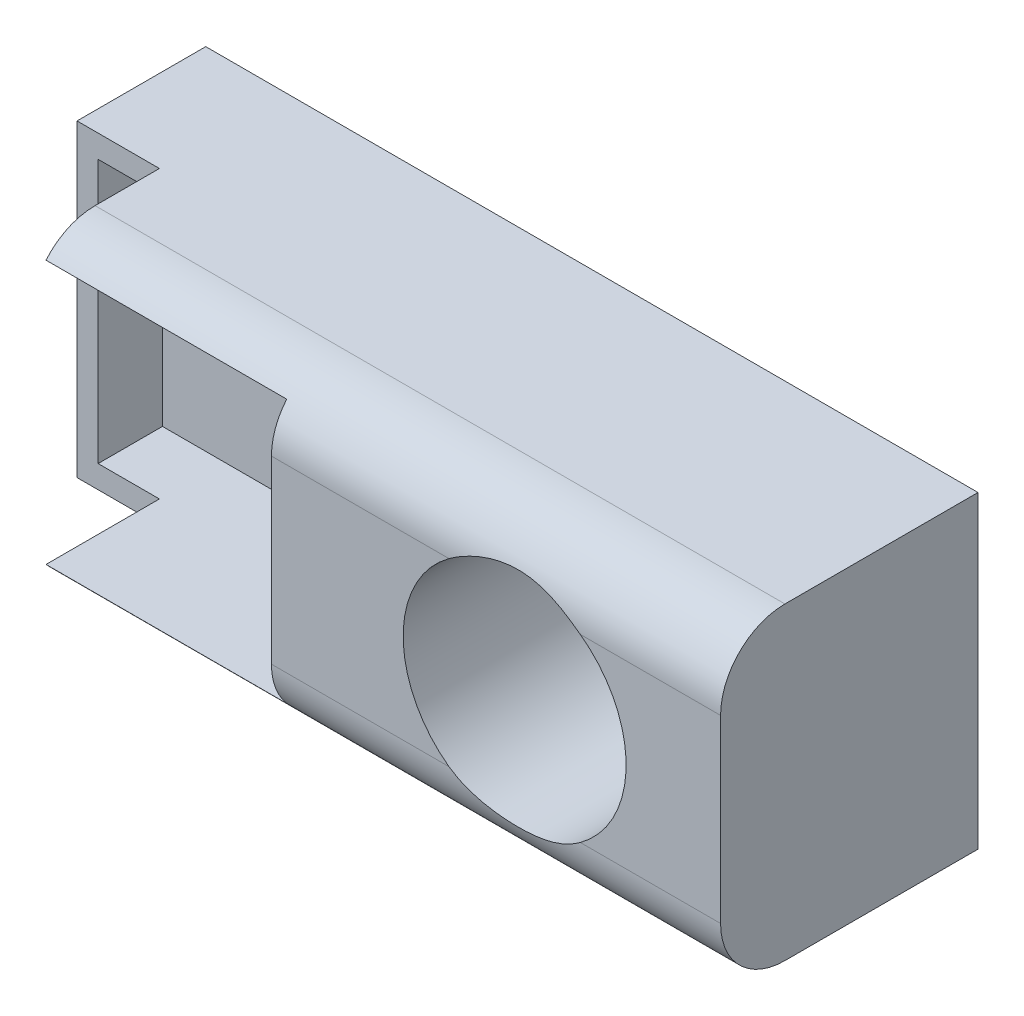
ISO-10303-21;
HEADER;
FILE_DESCRIPTION(('STEP AP214'),'2;1');
FILE_NAME('part.step','',(''),(''),'','','');
FILE_SCHEMA(('AUTOMOTIVE_DESIGN { 1 0 10303 214 1 1 1 1 }'));
ENDSEC;
DATA;
#1=APPLICATION_CONTEXT('core data for automotive mechanical design processes');
#2=APPLICATION_PROTOCOL_DEFINITION('international standard','automotive_design',2000,#1);
#3=PRODUCT_CONTEXT('',#1,'mechanical');
#4=PRODUCT('Part','Part','',(#3));
#5=PRODUCT_RELATED_PRODUCT_CATEGORY('part','',(#4));
#6=PRODUCT_DEFINITION_FORMATION('','',#4);
#7=PRODUCT_DEFINITION_CONTEXT('part definition',#1,'design');
#8=PRODUCT_DEFINITION('design','',#6,#7);
#9=PRODUCT_DEFINITION_SHAPE('','',#8);
#10=(LENGTH_UNIT() NAMED_UNIT(*) SI_UNIT(.MILLI.,.METRE.));
#11=(NAMED_UNIT(*) PLANE_ANGLE_UNIT() SI_UNIT($,.RADIAN.));
#12=(NAMED_UNIT(*) SI_UNIT($,.STERADIAN.) SOLID_ANGLE_UNIT());
#13=UNCERTAINTY_MEASURE_WITH_UNIT(LENGTH_MEASURE(1.E-05),#10,'distance_accuracy_value','');
#14=(GEOMETRIC_REPRESENTATION_CONTEXT(3) GLOBAL_UNCERTAINTY_ASSIGNED_CONTEXT((#13)) GLOBAL_UNIT_ASSIGNED_CONTEXT((#10,
#11,#12)) REPRESENTATION_CONTEXT('',''));
#15=CARTESIAN_POINT('',(0.,0.,0.));
#16=DIRECTION('',(0.,0.,1.));
#17=DIRECTION('',(1.,0.,0.));
#18=AXIS2_PLACEMENT_3D('',#15,#16,#17);
#19=CARTESIAN_POINT('',(9.525,3.81,6.35));
#20=DIRECTION('',(0.,0.,-1.));
#21=DIRECTION('',(-1.,0.,0.));
#22=AXIS2_PLACEMENT_3D('',#19,#20,#21);
#23=PLANE('',#22);
#24=DIRECTION('',(0.,1.,0.));
#25=VECTOR('',#24,1.);
#26=CARTESIAN_POINT('',(-1.555,-3.25,6.35));
#27=LINE('',#26,#25);
#28=CARTESIAN_POINT('',(-1.555,-2.2225,6.35));
#29=VERTEX_POINT('',#28);
#30=CARTESIAN_POINT('',(-1.555,2.2225,6.35));
#31=VERTEX_POINT('',#30);
#32=EDGE_CURVE('E195',#29,#31,#27,.T.);
#33=ORIENTED_EDGE('',*,*,#32,.F.);
#34=DIRECTION('',(1.,0.,0.));
#35=VECTOR('',#34,1.);
#36=CARTESIAN_POINT('',(9.525,-2.2225,6.35));
#37=LINE('',#36,#35);
#38=CARTESIAN_POINT('',(2.82543408593537,-2.2225,6.35));
#39=VERTEX_POINT('',#38);
#40=EDGE_CURVE('E244',#29,#39,#37,.T.);
#41=ORIENTED_EDGE('',*,*,#40,.T.);
#42=CARTESIAN_POINT('',(4.445,0.,6.35));
#43=DIRECTION('',(0.,0.,1.));
#44=DIRECTION('',(1.,0.,0.));
#45=AXIS2_PLACEMENT_3D('',#42,#43,#44);
#46=CIRCLE('',#45,2.75);
#47=CARTESIAN_POINT('',(2.82543408593537,2.2225,6.35));
#48=VERTEX_POINT('',#47);
#49=EDGE_CURVE('E207',#48,#39,#46,.T.);
#50=ORIENTED_EDGE('',*,*,#49,.F.);
#51=DIRECTION('',(-1.,0.,0.));
#52=VECTOR('',#51,1.);
#53=CARTESIAN_POINT('',(9.525,2.2225,6.35));
#54=LINE('',#53,#52);
#55=EDGE_CURVE('E237',#48,#31,#54,.T.);
#56=ORIENTED_EDGE('',*,*,#55,.T.);
#57=EDGE_LOOP('',(#33,#41,#50,#56));
#58=FACE_BOUND('',#57,.T.);
#59=ADVANCED_FACE('F30',(#58),#23,.F.);
#60=CARTESIAN_POINT('',(-9.005,-3.25,6.35));
#61=DIRECTION('',(0.,1.,0.));
#62=DIRECTION('',(0.,0.,1.));
#63=AXIS2_PLACEMENT_3D('',#60,#61,#62);
#64=PLANE('',#63);
#65=DIRECTION('',(0.,0.,-1.));
#66=VECTOR('',#65,1.);
#67=CARTESIAN_POINT('',(-7.49299999999999,-3.25,6.35));
#68=LINE('',#67,#66);
#69=CARTESIAN_POINT('',(-7.49299999999999,-3.25,5.97262396059247));
#70=VERTEX_POINT('',#69);
#71=CARTESIAN_POINT('',(-7.49299999999999,-3.25,3.175));
#72=VERTEX_POINT('',#71);
#73=EDGE_CURVE('E193',#70,#72,#68,.T.);
#74=ORIENTED_EDGE('',*,*,#73,.F.);
#75=DIRECTION('',(1.,0.,0.));
#76=VECTOR('',#75,1.);
#77=CARTESIAN_POINT('',(-7.49299999999999,-3.25,5.97262396059247));
#78=LINE('',#77,#76);
#79=CARTESIAN_POINT('',(-1.555,-3.25,5.97262396059247));
#80=VERTEX_POINT('',#79);
#81=EDGE_CURVE('E152',#70,#80,#78,.T.);
#82=ORIENTED_EDGE('',*,*,#81,.T.);
#83=DIRECTION('',(0.,0.,-1.));
#84=VECTOR('',#83,1.);
#85=CARTESIAN_POINT('',(-1.555,-3.25,6.35));
#86=LINE('',#85,#84);
#87=CARTESIAN_POINT('',(-1.555,-3.25,1.5875));
#88=VERTEX_POINT('',#87);
#89=EDGE_CURVE('E144',#80,#88,#86,.T.);
#90=ORIENTED_EDGE('',*,*,#89,.T.);
#91=DIRECTION('',(-1.,0.,0.));
#92=VECTOR('',#91,1.);
#93=CARTESIAN_POINT('',(-1.555,-3.25,1.5875));
#94=LINE('',#93,#92);
#95=CARTESIAN_POINT('',(-9.005,-3.25,1.5875));
#96=VERTEX_POINT('',#95);
#97=EDGE_CURVE('E149',#88,#96,#94,.T.);
#98=ORIENTED_EDGE('',*,*,#97,.T.);
#99=DIRECTION('',(0.,0.,-1.));
#100=VECTOR('',#99,1.);
#101=CARTESIAN_POINT('',(-9.005,-3.25,6.35));
#102=LINE('',#101,#100);
#103=CARTESIAN_POINT('',(-9.005,-3.25,3.175));
#104=VERTEX_POINT('',#103);
#105=EDGE_CURVE('E198',#104,#96,#102,.T.);
#106=ORIENTED_EDGE('',*,*,#105,.F.);
#107=DIRECTION('',(-1.,0.,0.));
#108=VECTOR('',#107,1.);
#109=CARTESIAN_POINT('',(-9.005,-3.25,3.175));
#110=LINE('',#109,#108);
#111=EDGE_CURVE('E191',#72,#104,#110,.T.);
#112=ORIENTED_EDGE('',*,*,#111,.F.);
#113=EDGE_LOOP('',(#74,#82,#90,#98,#106,#112));
#114=FACE_BOUND('',#113,.T.);
#115=ADVANCED_FACE('F147',(#114),#64,.T.);
#116=CARTESIAN_POINT('',(-1.555,-3.25,6.35));
#117=DIRECTION('',(-1.,0.,0.));
#118=DIRECTION('',(0.,0.,1.));
#119=AXIS2_PLACEMENT_3D('',#116,#117,#118);
#120=PLANE('',#119);
#121=ORIENTED_EDGE('',*,*,#89,.F.);
#122=CARTESIAN_POINT('',(-1.555,-2.2225,4.7625));
#123=DIRECTION('',(-1.,0.,0.));
#124=DIRECTION('',(0.,0.,1.));
#125=AXIS2_PLACEMENT_3D('',#122,#123,#124);
#126=CIRCLE('',#125,1.5875);
#127=EDGE_CURVE('E314',#80,#29,#126,.T.);
#128=ORIENTED_EDGE('',*,*,#127,.T.);
#129=ORIENTED_EDGE('',*,*,#32,.T.);
#130=CARTESIAN_POINT('',(-1.555,2.2225,4.7625));
#131=DIRECTION('',(-1.,0.,0.));
#132=DIRECTION('',(0.,0.,1.));
#133=AXIS2_PLACEMENT_3D('',#130,#131,#132);
#134=CIRCLE('',#133,1.5875);
#135=CARTESIAN_POINT('',(-1.555,3.25,5.97262396059247));
#136=VERTEX_POINT('',#135);
#137=EDGE_CURVE('E330',#31,#136,#134,.T.);
#138=ORIENTED_EDGE('',*,*,#137,.T.);
#139=DIRECTION('',(0.,0.,-1.));
#140=VECTOR('',#139,1.);
#141=CARTESIAN_POINT('',(-1.555,3.25,6.35));
#142=LINE('',#141,#140);
#143=CARTESIAN_POINT('',(-1.555,3.25,1.5875));
#144=VERTEX_POINT('',#143);
#145=EDGE_CURVE('E157',#136,#144,#142,.T.);
#146=ORIENTED_EDGE('',*,*,#145,.T.);
#147=DIRECTION('',(0.,-1.,0.));
#148=VECTOR('',#147,1.);
#149=CARTESIAN_POINT('',(-1.555,3.25,1.5875));
#150=LINE('',#149,#148);
#151=EDGE_CURVE('E162',#144,#88,#150,.T.);
#152=ORIENTED_EDGE('',*,*,#151,.T.);
#153=EDGE_LOOP('',(#121,#128,#129,#138,#146,#152));
#154=FACE_BOUND('',#153,.T.);
#155=ADVANCED_FACE('F167',(#154),#120,.T.);
#156=CARTESIAN_POINT('',(-1.555,3.25,6.35));
#157=DIRECTION('',(0.,-1.,0.));
#158=DIRECTION('',(0.,0.,-1.));
#159=AXIS2_PLACEMENT_3D('',#156,#157,#158);
#160=PLANE('',#159);
#161=ORIENTED_EDGE('',*,*,#145,.F.);
#162=DIRECTION('',(-1.,0.,0.));
#163=VECTOR('',#162,1.);
#164=CARTESIAN_POINT('',(-1.555,3.25,5.97262396059247));
#165=LINE('',#164,#163);
#166=CARTESIAN_POINT('',(-7.49299999999999,3.25,5.97262396059247));
#167=VERTEX_POINT('',#166);
#168=EDGE_CURVE('E53',#136,#167,#165,.T.);
#169=ORIENTED_EDGE('',*,*,#168,.T.);
#170=DIRECTION('',(0.,0.,1.));
#171=VECTOR('',#170,1.);
#172=CARTESIAN_POINT('',(-7.49299999999999,3.25,6.35));
#173=LINE('',#172,#171);
#174=CARTESIAN_POINT('',(-7.49299999999999,3.25,3.175));
#175=VERTEX_POINT('',#174);
#176=EDGE_CURVE('E235',#175,#167,#173,.T.);
#177=ORIENTED_EDGE('',*,*,#176,.F.);
#178=DIRECTION('',(1.,0.,0.));
#179=VECTOR('',#178,1.);
#180=CARTESIAN_POINT('',(-1.555,3.25,3.175));
#181=LINE('',#180,#179);
#182=CARTESIAN_POINT('',(-9.005,3.25,3.175));
#183=VERTEX_POINT('',#182);
#184=EDGE_CURVE('E186',#183,#175,#181,.T.);
#185=ORIENTED_EDGE('',*,*,#184,.F.);
#186=DIRECTION('',(0.,0.,-1.));
#187=VECTOR('',#186,1.);
#188=CARTESIAN_POINT('',(-9.005,3.25,6.35));
#189=LINE('',#188,#187);
#190=CARTESIAN_POINT('',(-9.005,3.25,1.5875));
#191=VERTEX_POINT('',#190);
#192=EDGE_CURVE('E200',#183,#191,#189,.T.);
#193=ORIENTED_EDGE('',*,*,#192,.T.);
#194=DIRECTION('',(1.,0.,0.));
#195=VECTOR('',#194,1.);
#196=CARTESIAN_POINT('',(-1.555,3.25,1.5875));
#197=LINE('',#196,#195);
#198=EDGE_CURVE('E171',#191,#144,#197,.T.);
#199=ORIENTED_EDGE('',*,*,#198,.T.);
#200=EDGE_LOOP('',(#161,#169,#177,#185,#193,#199));
#201=FACE_BOUND('',#200,.T.);
#202=ADVANCED_FACE('F333',(#201),#160,.T.);
#203=CARTESIAN_POINT('',(-9.005,3.25,6.35));
#204=DIRECTION('',(1.,0.,0.));
#205=DIRECTION('',(0.,0.,-1.));
#206=AXIS2_PLACEMENT_3D('',#203,#204,#205);
#207=PLANE('',#206);
#208=ORIENTED_EDGE('',*,*,#105,.T.);
#209=DIRECTION('',(0.,1.,0.));
#210=VECTOR('',#209,1.);
#211=CARTESIAN_POINT('',(-9.005,3.25,1.5875));
#212=LINE('',#211,#210);
#213=EDGE_CURVE('E165',#96,#191,#212,.T.);
#214=ORIENTED_EDGE('',*,*,#213,.T.);
#215=ORIENTED_EDGE('',*,*,#192,.F.);
#216=DIRECTION('',(0.,1.,0.));
#217=VECTOR('',#216,1.);
#218=CARTESIAN_POINT('',(-9.005,3.25,3.175));
#219=LINE('',#218,#217);
#220=EDGE_CURVE('E233',#104,#183,#219,.T.);
#221=ORIENTED_EDGE('',*,*,#220,.F.);
#222=EDGE_LOOP('',(#208,#214,#215,#221));
#223=FACE_BOUND('',#222,.T.);
#224=ADVANCED_FACE('F272',(#223),#207,.T.);
#225=CARTESIAN_POINT('',(6.06456591406463,-2.2225,6.35));
#226=VERTEX_POINT('',#225);
#227=CARTESIAN_POINT('',(6.06456591406463,2.2225,6.35));
#228=VERTEX_POINT('',#227);
#229=EDGE_CURVE('E204',#226,#228,#46,.T.);
#230=ORIENTED_EDGE('',*,*,#229,.F.);
#231=DIRECTION('',(1.,0.,0.));
#232=VECTOR('',#231,1.);
#233=CARTESIAN_POINT('',(9.525,-2.2225,6.35));
#234=LINE('',#233,#232);
#235=CARTESIAN_POINT('',(9.52500000000001,-2.2225,6.35));
#236=VERTEX_POINT('',#235);
#237=EDGE_CURVE('E242',#226,#236,#234,.T.);
#238=ORIENTED_EDGE('',*,*,#237,.T.);
#239=DIRECTION('',(0.,1.,0.));
#240=VECTOR('',#239,1.);
#241=CARTESIAN_POINT('',(9.52500000000001,-3.81,6.35));
#242=LINE('',#241,#240);
#243=CARTESIAN_POINT('',(9.52500000000001,2.2225,6.35));
#244=VERTEX_POINT('',#243);
#245=EDGE_CURVE('E210',#236,#244,#242,.T.);
#246=ORIENTED_EDGE('',*,*,#245,.T.);
#247=DIRECTION('',(-1.,0.,0.));
#248=VECTOR('',#247,1.);
#249=CARTESIAN_POINT('',(9.525,2.2225,6.35));
#250=LINE('',#249,#248);
#251=EDGE_CURVE('E239',#244,#228,#250,.T.);
#252=ORIENTED_EDGE('',*,*,#251,.T.);
#253=EDGE_LOOP('',(#230,#238,#246,#252));
#254=FACE_BOUND('',#253,.T.);
#255=ADVANCED_FACE('F267',(#254),#23,.F.);
#256=CARTESIAN_POINT('',(9.525,3.81,0.));
#257=DIRECTION('',(0.,0.,-1.));
#258=DIRECTION('',(-1.,0.,0.));
#259=AXIS2_PLACEMENT_3D('',#256,#257,#258);
#260=PLANE('',#259);
#261=CARTESIAN_POINT('',(4.445,0.,0.));
#262=DIRECTION('',(0.,0.,1.));
#263=DIRECTION('',(1.,0.,0.));
#264=AXIS2_PLACEMENT_3D('',#261,#262,#263);
#265=CIRCLE('',#264,2.75);
#266=CARTESIAN_POINT('',(7.195,0.,0.));
#267=VERTEX_POINT('',#266);
#268=EDGE_CURVE('E156',#267,#267,#265,.T.);
#269=ORIENTED_EDGE('',*,*,#268,.T.);
#270=EDGE_LOOP('',(#269));
#271=FACE_BOUND('',#270,.T.);
#272=DIRECTION('',(0.,1.,0.));
#273=VECTOR('',#272,1.);
#274=CARTESIAN_POINT('',(9.52500000000001,-3.81,0.));
#275=LINE('',#274,#273);
#276=CARTESIAN_POINT('',(9.52500000000001,-3.81,0.));
#277=VERTEX_POINT('',#276);
#278=CARTESIAN_POINT('',(9.52500000000001,3.81,0.));
#279=VERTEX_POINT('',#278);
#280=EDGE_CURVE('E215',#277,#279,#275,.T.);
#281=ORIENTED_EDGE('',*,*,#280,.F.);
#282=DIRECTION('',(1.,0.,0.));
#283=VECTOR('',#282,1.);
#284=CARTESIAN_POINT('',(-9.52499999999999,-3.81,0.));
#285=LINE('',#284,#283);
#286=CARTESIAN_POINT('',(-9.52499999999999,-3.81,0.));
#287=VERTEX_POINT('',#286);
#288=EDGE_CURVE('E214',#287,#277,#285,.T.);
#289=ORIENTED_EDGE('',*,*,#288,.F.);
#290=DIRECTION('',(0.,-1.,0.));
#291=VECTOR('',#290,1.);
#292=CARTESIAN_POINT('',(-9.52499999999999,-3.81,0.));
#293=LINE('',#292,#291);
#294=CARTESIAN_POINT('',(-9.52499999999999,3.81,0.));
#295=VERTEX_POINT('',#294);
#296=EDGE_CURVE('E221',#295,#287,#293,.T.);
#297=ORIENTED_EDGE('',*,*,#296,.F.);
#298=DIRECTION('',(-1.,0.,0.));
#299=VECTOR('',#298,1.);
#300=CARTESIAN_POINT('',(-9.52499999999999,3.81,0.));
#301=LINE('',#300,#299);
#302=EDGE_CURVE('E218',#279,#295,#301,.T.);
#303=ORIENTED_EDGE('',*,*,#302,.F.);
#304=EDGE_LOOP('',(#281,#289,#297,#303));
#305=FACE_BOUND('',#304,.T.);
#306=ADVANCED_FACE('F271',(#271,#305),#260,.T.);
#307=CARTESIAN_POINT('',(9.52500000000001,-3.81,6.35));
#308=DIRECTION('',(-1.,0.,0.));
#309=DIRECTION('',(0.,0.,1.));
#310=AXIS2_PLACEMENT_3D('',#307,#308,#309);
#311=PLANE('',#310);
#312=ORIENTED_EDGE('',*,*,#245,.F.);
#313=CARTESIAN_POINT('',(9.52500000000001,-2.2225,4.7625));
#314=DIRECTION('',(-1.,0.,0.));
#315=DIRECTION('',(0.,0.,1.));
#316=AXIS2_PLACEMENT_3D('',#313,#314,#315);
#317=CIRCLE('',#316,1.5875);
#318=CARTESIAN_POINT('',(9.52500000000001,-3.81,4.7625));
#319=VERTEX_POINT('',#318);
#320=EDGE_CURVE('E319',#236,#319,#317,.F.);
#321=ORIENTED_EDGE('',*,*,#320,.T.);
#322=DIRECTION('',(0.,0.,-1.));
#323=VECTOR('',#322,1.);
#324=CARTESIAN_POINT('',(9.52500000000001,-3.81,6.35));
#325=LINE('',#324,#323);
#326=EDGE_CURVE('E213',#319,#277,#325,.T.);
#327=ORIENTED_EDGE('',*,*,#326,.T.);
#328=ORIENTED_EDGE('',*,*,#280,.T.);
#329=DIRECTION('',(0.,0.,-1.));
#330=VECTOR('',#329,1.);
#331=CARTESIAN_POINT('',(9.52500000000001,3.81,6.35));
#332=LINE('',#331,#330);
#333=CARTESIAN_POINT('',(9.52500000000001,3.81,4.7625));
#334=VERTEX_POINT('',#333);
#335=EDGE_CURVE('E231',#334,#279,#332,.T.);
#336=ORIENTED_EDGE('',*,*,#335,.F.);
#337=CARTESIAN_POINT('',(9.52500000000001,2.2225,4.7625));
#338=DIRECTION('',(-1.,0.,0.));
#339=DIRECTION('',(0.,0.,1.));
#340=AXIS2_PLACEMENT_3D('',#337,#338,#339);
#341=CIRCLE('',#340,1.5875);
#342=EDGE_CURVE('E318',#334,#244,#341,.F.);
#343=ORIENTED_EDGE('',*,*,#342,.T.);
#344=EDGE_LOOP('',(#312,#321,#327,#328,#336,#343));
#345=FACE_BOUND('',#344,.T.);
#346=ADVANCED_FACE('F276',(#345),#311,.F.);
#347=CARTESIAN_POINT('',(-9.52499999999999,3.81,6.35));
#348=DIRECTION('',(0.,-1.,0.));
#349=DIRECTION('',(0.,0.,-1.));
#350=AXIS2_PLACEMENT_3D('',#347,#348,#349);
#351=PLANE('',#350);
#352=DIRECTION('',(0.,0.,-1.));
#353=VECTOR('',#352,1.);
#354=CARTESIAN_POINT('',(-7.49299999999999,3.81,6.35));
#355=LINE('',#354,#353);
#356=CARTESIAN_POINT('',(-7.49299999999999,3.81,4.7625));
#357=VERTEX_POINT('',#356);
#358=CARTESIAN_POINT('',(-7.49299999999999,3.81,3.175));
#359=VERTEX_POINT('',#358);
#360=EDGE_CURVE('E173',#357,#359,#355,.T.);
#361=ORIENTED_EDGE('',*,*,#360,.F.);
#362=DIRECTION('',(-1.,0.,0.));
#363=VECTOR('',#362,1.);
#364=CARTESIAN_POINT('',(-9.52499999999999,3.81,4.7625));
#365=LINE('',#364,#363);
#366=EDGE_CURVE('E11',#357,#334,#365,.F.);
#367=ORIENTED_EDGE('',*,*,#366,.T.);
#368=ORIENTED_EDGE('',*,*,#335,.T.);
#369=ORIENTED_EDGE('',*,*,#302,.T.);
#370=DIRECTION('',(0.,0.,-1.));
#371=VECTOR('',#370,1.);
#372=CARTESIAN_POINT('',(-9.52499999999999,3.81,6.35));
#373=LINE('',#372,#371);
#374=CARTESIAN_POINT('',(-9.52499999999999,3.81,3.175));
#375=VERTEX_POINT('',#374);
#376=EDGE_CURVE('E229',#375,#295,#373,.T.);
#377=ORIENTED_EDGE('',*,*,#376,.F.);
#378=DIRECTION('',(-1.,0.,0.));
#379=VECTOR('',#378,1.);
#380=CARTESIAN_POINT('',(-9.52499999999999,3.81,3.175));
#381=LINE('',#380,#379);
#382=EDGE_CURVE('E177',#359,#375,#381,.T.);
#383=ORIENTED_EDGE('',*,*,#382,.F.);
#384=EDGE_LOOP('',(#361,#367,#368,#369,#377,#383));
#385=FACE_BOUND('',#384,.T.);
#386=ADVANCED_FACE('F284',(#385),#351,.F.);
#387=CARTESIAN_POINT('',(-9.52499999999999,-3.81,6.35));
#388=DIRECTION('',(1.,0.,0.));
#389=DIRECTION('',(0.,0.,-1.));
#390=AXIS2_PLACEMENT_3D('',#387,#388,#389);
#391=PLANE('',#390);
#392=DIRECTION('',(0.,0.,-1.));
#393=VECTOR('',#392,1.);
#394=CARTESIAN_POINT('',(-9.52499999999999,-3.81,6.35));
#395=LINE('',#394,#393);
#396=CARTESIAN_POINT('',(-9.52499999999999,-3.81,3.175));
#397=VERTEX_POINT('',#396);
#398=EDGE_CURVE('E227',#397,#287,#395,.T.);
#399=ORIENTED_EDGE('',*,*,#398,.F.);
#400=DIRECTION('',(0.,1.,0.));
#401=VECTOR('',#400,1.);
#402=CARTESIAN_POINT('',(-9.52499999999999,-3.81,3.175));
#403=LINE('',#402,#401);
#404=EDGE_CURVE('E183',#397,#375,#403,.T.);
#405=ORIENTED_EDGE('',*,*,#404,.T.);
#406=ORIENTED_EDGE('',*,*,#376,.T.);
#407=ORIENTED_EDGE('',*,*,#296,.T.);
#408=EDGE_LOOP('',(#399,#405,#406,#407));
#409=FACE_BOUND('',#408,.T.);
#410=ADVANCED_FACE('F280',(#409),#391,.F.);
#411=CARTESIAN_POINT('',(-9.52499999999999,-3.81,6.35));
#412=DIRECTION('',(0.,1.,0.));
#413=DIRECTION('',(-1.,0.,0.));
#414=AXIS2_PLACEMENT_3D('',#411,#412,#413);
#415=PLANE('',#414);
#416=ORIENTED_EDGE('',*,*,#326,.F.);
#417=DIRECTION('',(1.,0.,0.));
#418=VECTOR('',#417,1.);
#419=CARTESIAN_POINT('',(-9.52499999999999,-3.81,4.7625));
#420=LINE('',#419,#418);
#421=CARTESIAN_POINT('',(-7.49299999999999,-3.81,4.7625));
#422=VERTEX_POINT('',#421);
#423=EDGE_CURVE('E323',#319,#422,#420,.F.);
#424=ORIENTED_EDGE('',*,*,#423,.T.);
#425=DIRECTION('',(0.,0.,-1.));
#426=VECTOR('',#425,1.);
#427=CARTESIAN_POINT('',(-7.49299999999999,-3.81,6.35));
#428=LINE('',#427,#426);
#429=CARTESIAN_POINT('',(-7.49299999999999,-3.81,3.175));
#430=VERTEX_POINT('',#429);
#431=EDGE_CURVE('E174',#422,#430,#428,.T.);
#432=ORIENTED_EDGE('',*,*,#431,.T.);
#433=DIRECTION('',(-1.,0.,0.));
#434=VECTOR('',#433,1.);
#435=CARTESIAN_POINT('',(-9.52499999999999,-3.81,3.175));
#436=LINE('',#435,#434);
#437=EDGE_CURVE('E176',#430,#397,#436,.T.);
#438=ORIENTED_EDGE('',*,*,#437,.T.);
#439=ORIENTED_EDGE('',*,*,#398,.T.);
#440=ORIENTED_EDGE('',*,*,#288,.T.);
#441=EDGE_LOOP('',(#416,#424,#432,#438,#439,#440));
#442=FACE_BOUND('',#441,.T.);
#443=ADVANCED_FACE('F264',(#442),#415,.F.);
#444=CARTESIAN_POINT('',(4.445,0.,6.35));
#445=DIRECTION('',(0.,0.,-1.));
#446=DIRECTION('',(-1.,0.,0.));
#447=AXIS2_PLACEMENT_3D('',#444,#445,#446);
#448=CYLINDRICAL_SURFACE('',#447,2.75);
#449=ORIENTED_EDGE('',*,*,#49,.T.);
#450=CARTESIAN_POINT('',(2.82543408593537,-2.2225,6.35));
#451=CARTESIAN_POINT('',(2.87974329567324,-2.26208280825696,6.34998870675463));
#452=CARTESIAN_POINT('',(2.9354839989434,-2.29964716872395,6.34851992967985));
#453=CARTESIAN_POINT('',(3.04945734857437,-2.37053850640142,6.34348439630068));
#454=CARTESIAN_POINT('',(3.10768819537836,-2.40386847676262,6.33991913208118));
#455=CARTESIAN_POINT('',(3.22646994404614,-2.46621082604367,6.33149669901119));
#456=CARTESIAN_POINT('',(3.28702533544644,-2.49521426060006,6.32663691015178));
#457=CARTESIAN_POINT('',(3.41006699650036,-2.54870841520278,6.31636190785978));
#458=CARTESIAN_POINT('',(3.47255374024657,-2.57319801679087,6.31094655728359));
#459=CARTESIAN_POINT('',(3.60587163637384,-2.61989814978069,6.299662483296));
#460=CARTESIAN_POINT('',(3.67688543846429,-2.64159230571848,6.29380651474037));
#461=CARTESIAN_POINT('',(3.82050072599258,-2.67918082467239,6.28302022118273));
#462=CARTESIAN_POINT('',(3.89310218083345,-2.69507529935475,6.27808987835974));
#463=CARTESIAN_POINT('',(4.03932371122309,-2.72092431708339,6.26978702005158));
#464=CARTESIAN_POINT('',(4.11294191462872,-2.73088858854382,6.26641195521989));
#465=CARTESIAN_POINT('',(4.26080734270379,-2.74482918821537,6.26162748275628));
#466=CARTESIAN_POINT('',(4.33505455293387,-2.74880565350883,6.2602180301245));
#467=CARTESIAN_POINT('',(4.48475847855791,-2.75074660418093,6.25953480553885));
#468=CARTESIAN_POINT('',(4.56021655433018,-2.74861955638549,6.26029354888747));
#469=CARTESIAN_POINT('',(4.71065202609327,-2.73817724361417,6.26392041975378));
#470=CARTESIAN_POINT('',(4.7856294061751,-2.72986177488319,6.26678861672564));
#471=CARTESIAN_POINT('',(4.93469812702935,-2.70710026375402,6.27427443165346));
#472=CARTESIAN_POINT('',(5.00878755915236,-2.69264284084571,6.27889529543721));
#473=CARTESIAN_POINT('',(5.15545294677838,-2.65771332796596,6.28928646223672));
#474=CARTESIAN_POINT('',(5.22802882961574,-2.63724094992465,6.29505682030012));
#475=CARTESIAN_POINT('',(5.36794614295526,-2.59149324323641,6.30669260168264));
#476=CARTESIAN_POINT('',(5.43537509272607,-2.56648074156253,6.31254157545506));
#477=CARTESIAN_POINT('',(5.56808716491849,-2.51124289067942,6.32377419225814));
#478=CARTESIAN_POINT('',(5.6333707574273,-2.48101869263922,6.32915793765593));
#479=CARTESIAN_POINT('',(5.76132510782882,-2.41556161000051,6.33856384828279));
#480=CARTESIAN_POINT('',(5.82400083368104,-2.38033887114218,6.34258871708872));
#481=CARTESIAN_POINT('',(5.94652154406328,-2.30502033069076,6.34830016905597));
#482=CARTESIAN_POINT('',(6.00636439661576,-2.26492093752444,6.34998501735035));
#483=CARTESIAN_POINT('',(6.06456591406463,-2.2225,6.35));
#484=B_SPLINE_CURVE_WITH_KNOTS('',3,(#450,#451,#452,#453,#454,#455,#456,#457,#458,#459,#460,
#461,#462,#463,#464,#465,#466,#467,#468,#469,#470,#471,#472,#473,#474,#475,#476,#477,#478,#479,
#480,#481,#482,#483),.UNSPECIFIED.,.F.,.F.,(4,2,2,2,2,2,2,2,2,2,2,2,2,2,2,2,4),(0.,
0.201504257971385,0.402865277200524,0.604636972124373,0.806458595949517,1.0296632841292,
1.25286367453026,1.47569689128738,1.6985250065161,1.92471221570865,2.15090687249348,
2.37752248909185,2.60414896059721,2.82039905657186,3.03660144787218,3.25237111953474,
3.46830067535573),.UNSPECIFIED.);
#485=EDGE_CURVE('E253',#39,#226,#484,.T.);
#486=ORIENTED_EDGE('',*,*,#485,.T.);
#487=ORIENTED_EDGE('',*,*,#229,.T.);
#488=CARTESIAN_POINT('',(6.06456591406463,2.2225,6.35));
#489=CARTESIAN_POINT('',(6.01025670432676,2.26208280825697,6.34998870675463));
#490=CARTESIAN_POINT('',(5.9545160010566,2.29964716872395,6.34851992967985));
#491=CARTESIAN_POINT('',(5.84054265142563,2.37053850640142,6.34348439630068));
#492=CARTESIAN_POINT('',(5.78231180462164,2.40386847676262,6.33991913208118));
#493=CARTESIAN_POINT('',(5.66353005595385,2.46621082604367,6.33149669901119));
#494=CARTESIAN_POINT('',(5.60297466455355,2.49521426060006,6.32663691015178));
#495=CARTESIAN_POINT('',(5.47993300349964,2.54870841520278,6.31636190785978));
#496=CARTESIAN_POINT('',(5.41744625975343,2.57319801679087,6.31094655728359));
#497=CARTESIAN_POINT('',(5.28412836362615,2.61989814978069,6.299662483296));
#498=CARTESIAN_POINT('',(5.21311456153571,2.64159230571849,6.29380651474037));
#499=CARTESIAN_POINT('',(5.06949927400742,2.67918082467239,6.28302022118273));
#500=CARTESIAN_POINT('',(4.99689781916654,2.69507529935475,6.27808987835974));
#501=CARTESIAN_POINT('',(4.85067628877691,2.72092431708339,6.26978702005158));
#502=CARTESIAN_POINT('',(4.77705808537128,2.73088858854382,6.26641195521989));
#503=CARTESIAN_POINT('',(4.62919265729621,2.74482918821537,6.26162748275628));
#504=CARTESIAN_POINT('',(4.55494544706613,2.74880565350883,6.2602180301245));
#505=CARTESIAN_POINT('',(4.40524152144209,2.75074660418093,6.25953480553885));
#506=CARTESIAN_POINT('',(4.32978344566982,2.74861955638549,6.26029354888747));
#507=CARTESIAN_POINT('',(4.17934797390672,2.73817724361417,6.26392041975378));
#508=CARTESIAN_POINT('',(4.1043705938249,2.72986177488319,6.26678861672564));
#509=CARTESIAN_POINT('',(3.95530187297065,2.70710026375402,6.27427443165346));
#510=CARTESIAN_POINT('',(3.88121244084763,2.69264284084571,6.27889529543721));
#511=CARTESIAN_POINT('',(3.73454705322162,2.65771332796596,6.28928646223672));
#512=CARTESIAN_POINT('',(3.66197117038426,2.63724094992465,6.29505682030011));
#513=CARTESIAN_POINT('',(3.52205385704473,2.59149324323641,6.30669260168264));
#514=CARTESIAN_POINT('',(3.45462490727393,2.56648074156253,6.31254157545506));
#515=CARTESIAN_POINT('',(3.32191283508151,2.51124289067941,6.32377419225814));
#516=CARTESIAN_POINT('',(3.2566292425727,2.48101869263922,6.32915793765593));
#517=CARTESIAN_POINT('',(3.12867489217118,2.41556161000051,6.33856384828279));
#518=CARTESIAN_POINT('',(3.06599916631895,2.38033887114218,6.34258871708872));
#519=CARTESIAN_POINT('',(2.94347845593672,2.30502033069076,6.34830016905597));
#520=CARTESIAN_POINT('',(2.88363560338424,2.26492093752444,6.34998501735035));
#521=CARTESIAN_POINT('',(2.82543408593537,2.2225,6.35));
#522=B_SPLINE_CURVE_WITH_KNOTS('',3,(#488,#489,#490,#491,#492,#493,#494,#495,#496,#497,#498,
#499,#500,#501,#502,#503,#504,#505,#506,#507,#508,#509,#510,#511,#512,#513,#514,#515,#516,#517,
#518,#519,#520,#521),.UNSPECIFIED.,.F.,.F.,(4,2,2,2,2,2,2,2,2,2,2,2,2,2,2,2,4),(0.,
0.201504257971385,0.402865277200524,0.604636972124373,0.806458595949517,1.02966328412919,
1.25286367453026,1.47569689128737,1.6985250065161,1.92471221570865,2.15090687249348,
2.37752248909185,2.60414896059722,2.82039905657186,3.03660144787218,3.25237111953474,
3.46830067535573),.UNSPECIFIED.);
#523=EDGE_CURVE('E247',#228,#48,#522,.T.);
#524=ORIENTED_EDGE('',*,*,#523,.T.);
#525=EDGE_LOOP('',(#449,#486,#487,#524));
#526=FACE_BOUND('',#525,.T.);
#527=ORIENTED_EDGE('',*,*,#268,.F.);
#528=EDGE_LOOP('',(#527));
#529=FACE_BOUND('',#528,.T.);
#530=ADVANCED_FACE('F258',(#526,#529),#448,.F.);
#531=CARTESIAN_POINT('',(-7.49299999999999,-3.81,6.35));
#532=DIRECTION('',(1.,0.,0.));
#533=DIRECTION('',(0.,0.,-1.));
#534=AXIS2_PLACEMENT_3D('',#531,#532,#533);
#535=PLANE('',#534);
#536=ORIENTED_EDGE('',*,*,#431,.F.);
#537=CARTESIAN_POINT('',(-7.49299999999999,-2.2225,4.7625));
#538=DIRECTION('',(1.,0.,0.));
#539=DIRECTION('',(0.,0.,-1.));
#540=AXIS2_PLACEMENT_3D('',#537,#538,#539);
#541=CIRCLE('',#540,1.5875);
#542=EDGE_CURVE('E327',#422,#70,#541,.F.);
#543=ORIENTED_EDGE('',*,*,#542,.T.);
#544=ORIENTED_EDGE('',*,*,#73,.T.);
#545=DIRECTION('',(0.,1.,0.));
#546=VECTOR('',#545,1.);
#547=CARTESIAN_POINT('',(-7.49299999999999,-3.81,3.175));
#548=LINE('',#547,#546);
#549=EDGE_CURVE('E187',#430,#72,#548,.T.);
#550=ORIENTED_EDGE('',*,*,#549,.F.);
#551=EDGE_LOOP('',(#536,#543,#544,#550));
#552=FACE_BOUND('',#551,.T.);
#553=ADVANCED_FACE('F263',(#552),#535,.F.);
#554=CARTESIAN_POINT('',(-9.52499999999999,-3.81,3.175));
#555=DIRECTION('',(0.,0.,-1.));
#556=DIRECTION('',(-1.,0.,0.));
#557=AXIS2_PLACEMENT_3D('',#554,#555,#556);
#558=PLANE('',#557);
#559=ORIENTED_EDGE('',*,*,#111,.T.);
#560=ORIENTED_EDGE('',*,*,#220,.T.);
#561=ORIENTED_EDGE('',*,*,#184,.T.);
#562=EDGE_CURVE('E180',#175,#359,#548,.T.);
#563=ORIENTED_EDGE('',*,*,#562,.T.);
#564=ORIENTED_EDGE('',*,*,#382,.T.);
#565=ORIENTED_EDGE('',*,*,#404,.F.);
#566=ORIENTED_EDGE('',*,*,#437,.F.);
#567=ORIENTED_EDGE('',*,*,#549,.T.);
#568=EDGE_LOOP('',(#559,#560,#561,#563,#564,#565,#566,#567));
#569=FACE_BOUND('',#568,.T.);
#570=ADVANCED_FACE('F347',(#569),#558,.F.);
#571=ORIENTED_EDGE('',*,*,#176,.T.);
#572=CARTESIAN_POINT('',(-7.49299999999999,2.2225,4.7625));
#573=DIRECTION('',(1.,0.,0.));
#574=DIRECTION('',(0.,0.,-1.));
#575=AXIS2_PLACEMENT_3D('',#572,#573,#574);
#576=CIRCLE('',#575,1.5875);
#577=EDGE_CURVE('E39',#167,#357,#576,.F.);
#578=ORIENTED_EDGE('',*,*,#577,.T.);
#579=ORIENTED_EDGE('',*,*,#360,.T.);
#580=ORIENTED_EDGE('',*,*,#562,.F.);
#581=EDGE_LOOP('',(#571,#578,#579,#580));
#582=FACE_BOUND('',#581,.T.);
#583=ADVANCED_FACE('F300',(#582),#535,.F.);
#584=CARTESIAN_POINT('',(-1.555,-3.25,1.5875));
#585=DIRECTION('',(0.,0.,-1.));
#586=DIRECTION('',(-1.,0.,0.));
#587=AXIS2_PLACEMENT_3D('',#584,#585,#586);
#588=PLANE('',#587);
#589=ORIENTED_EDGE('',*,*,#151,.F.);
#590=ORIENTED_EDGE('',*,*,#198,.F.);
#591=ORIENTED_EDGE('',*,*,#213,.F.);
#592=ORIENTED_EDGE('',*,*,#97,.F.);
#593=EDGE_LOOP('',(#589,#590,#591,#592));
#594=FACE_BOUND('',#593,.T.);
#595=ADVANCED_FACE('F161',(#594),#588,.F.);
#596=CARTESIAN_POINT('',(9.525,-2.2225,4.7625));
#597=DIRECTION('',(1.,0.,0.));
#598=DIRECTION('',(0.,1.,0.));
#599=AXIS2_PLACEMENT_3D('',#596,#597,#598);
#600=CYLINDRICAL_SURFACE('',#599,1.5875);
#601=ORIENTED_EDGE('',*,*,#542,.F.);
#602=ORIENTED_EDGE('',*,*,#423,.F.);
#603=ORIENTED_EDGE('',*,*,#320,.F.);
#604=ORIENTED_EDGE('',*,*,#237,.F.);
#605=ORIENTED_EDGE('',*,*,#485,.F.);
#606=ORIENTED_EDGE('',*,*,#40,.F.);
#607=ORIENTED_EDGE('',*,*,#127,.F.);
#608=ORIENTED_EDGE('',*,*,#81,.F.);
#609=EDGE_LOOP('',(#601,#602,#603,#604,#605,#606,#607,#608));
#610=FACE_BOUND('',#609,.T.);
#611=ADVANCED_FACE('F291',(#610),#600,.T.);
#612=CARTESIAN_POINT('',(9.525,2.2225,4.7625));
#613=DIRECTION('',(-1.,0.,0.));
#614=DIRECTION('',(0.,0.,1.));
#615=AXIS2_PLACEMENT_3D('',#612,#613,#614);
#616=CYLINDRICAL_SURFACE('',#615,1.5875);
#617=ORIENTED_EDGE('',*,*,#342,.F.);
#618=ORIENTED_EDGE('',*,*,#366,.F.);
#619=ORIENTED_EDGE('',*,*,#577,.F.);
#620=ORIENTED_EDGE('',*,*,#168,.F.);
#621=ORIENTED_EDGE('',*,*,#137,.F.);
#622=ORIENTED_EDGE('',*,*,#55,.F.);
#623=ORIENTED_EDGE('',*,*,#523,.F.);
#624=ORIENTED_EDGE('',*,*,#251,.F.);
#625=EDGE_LOOP('',(#617,#618,#619,#620,#621,#622,#623,#624));
#626=FACE_BOUND('',#625,.T.);
#627=ADVANCED_FACE('F32',(#626),#616,.T.);
#628=CLOSED_SHELL('',(#59,#115,#155,#202,#224,#255,#306,#346,#386,#410,#443,#530,#553,#570,#583,
#595,#611,#627));
#629=MANIFOLD_SOLID_BREP('B2',#628);
#630=ADVANCED_BREP_SHAPE_REPRESENTATION('',(#18,#629),#14);
#631=SHAPE_DEFINITION_REPRESENTATION(#9,#630);
ENDSEC;
END-ISO-10303-21;
